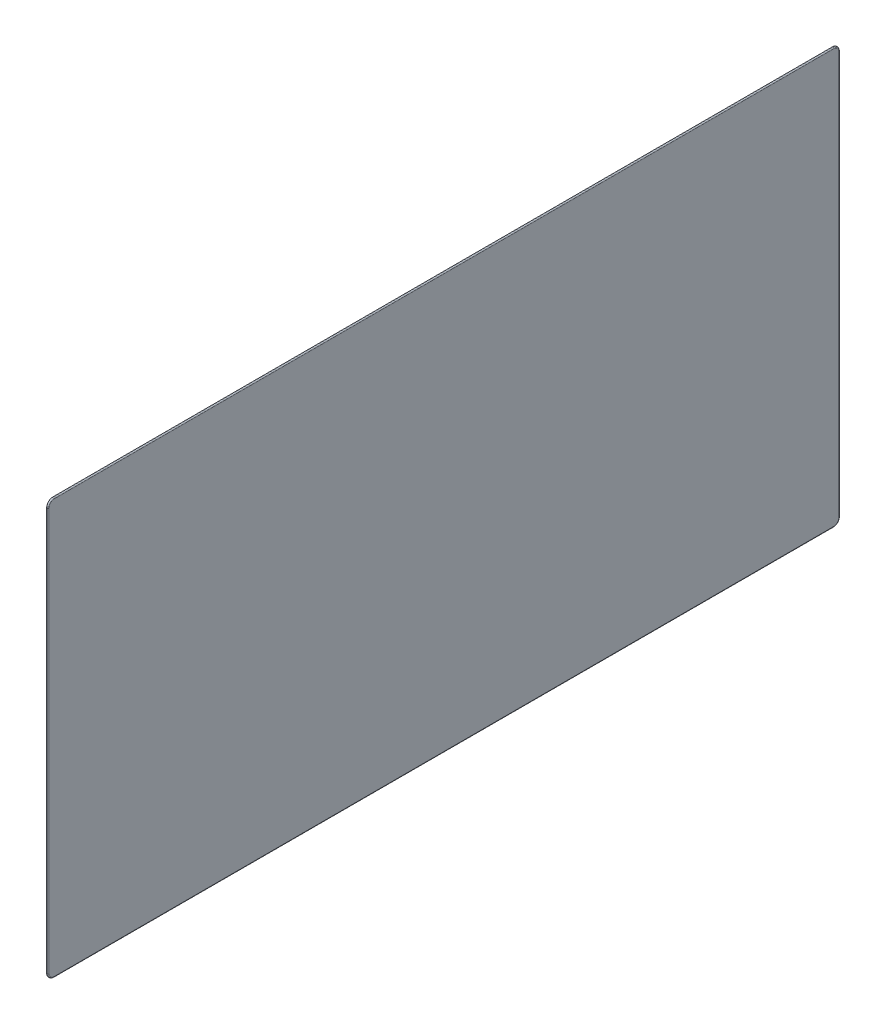
ISO-10303-21;
HEADER;
FILE_DESCRIPTION(('STEP AP214'),'2;1');
FILE_NAME('part.step','',(''),(''),'','','');
FILE_SCHEMA(('AUTOMOTIVE_DESIGN { 1 0 10303 214 1 1 1 1 }'));
ENDSEC;
DATA;
#1=APPLICATION_CONTEXT('core data for automotive mechanical design processes');
#2=APPLICATION_PROTOCOL_DEFINITION('international standard','automotive_design',2000,#1);
#3=PRODUCT_CONTEXT('',#1,'mechanical');
#4=PRODUCT('Part','Part','',(#3));
#5=PRODUCT_RELATED_PRODUCT_CATEGORY('part','',(#4));
#6=PRODUCT_DEFINITION_FORMATION('','',#4);
#7=PRODUCT_DEFINITION_CONTEXT('part definition',#1,'design');
#8=PRODUCT_DEFINITION('design','',#6,#7);
#9=PRODUCT_DEFINITION_SHAPE('','',#8);
#10=(LENGTH_UNIT() NAMED_UNIT(*) SI_UNIT(.MILLI.,.METRE.));
#11=(NAMED_UNIT(*) PLANE_ANGLE_UNIT() SI_UNIT($,.RADIAN.));
#12=(NAMED_UNIT(*) SI_UNIT($,.STERADIAN.) SOLID_ANGLE_UNIT());
#13=UNCERTAINTY_MEASURE_WITH_UNIT(LENGTH_MEASURE(1.E-05),#10,'distance_accuracy_value','');
#14=(GEOMETRIC_REPRESENTATION_CONTEXT(3) GLOBAL_UNCERTAINTY_ASSIGNED_CONTEXT((#13)) GLOBAL_UNIT_ASSIGNED_CONTEXT((#10,
#11,#12)) REPRESENTATION_CONTEXT('',''));
#15=CARTESIAN_POINT('',(0.,0.,0.));
#16=DIRECTION('',(0.,0.,1.));
#17=DIRECTION('',(1.,0.,0.));
#18=AXIS2_PLACEMENT_3D('',#15,#16,#17);
#19=CARTESIAN_POINT('',(717.31,75.9999999999999,-182.218894283865));
#20=DIRECTION('',(-1.,0.,0.));
#21=DIRECTION('',(0.,0.,1.));
#22=AXIS2_PLACEMENT_3D('',#19,#20,#21);
#23=CYLINDRICAL_SURFACE('',#22,3.);
#24=DIRECTION('',(-1.,0.,0.));
#25=VECTOR('',#24,1.);
#26=CARTESIAN_POINT('',(717.31,76.,-185.218894283865));
#27=LINE('',#26,#25);
#28=CARTESIAN_POINT('',(716.81,76.,-185.218894283865));
#29=VERTEX_POINT('',#28);
#30=CARTESIAN_POINT('',(716.7,76.,-185.218894283865));
#31=VERTEX_POINT('',#30);
#32=EDGE_CURVE('E123',#29,#31,#27,.T.);
#33=ORIENTED_EDGE('',*,*,#32,.F.);
#34=CARTESIAN_POINT('',(716.81,75.9999999999999,-182.218894283865));
#35=DIRECTION('',(1.,0.,0.));
#36=DIRECTION('',(0.,0.,-1.));
#37=AXIS2_PLACEMENT_3D('',#34,#35,#36);
#38=CIRCLE('',#37,3.);
#39=CARTESIAN_POINT('',(716.81,72.9999999999999,-182.218894283865));
#40=VERTEX_POINT('',#39);
#41=EDGE_CURVE('E11',#29,#40,#38,.F.);
#42=ORIENTED_EDGE('',*,*,#41,.T.);
#43=DIRECTION('',(-1.,0.,0.));
#44=VECTOR('',#43,1.);
#45=CARTESIAN_POINT('',(717.31,72.9999999999999,-182.218894283865));
#46=LINE('',#45,#44);
#47=CARTESIAN_POINT('',(716.7,72.9999999999999,-182.218894283865));
#48=VERTEX_POINT('',#47);
#49=EDGE_CURVE('E144',#40,#48,#46,.T.);
#50=ORIENTED_EDGE('',*,*,#49,.T.);
#51=CARTESIAN_POINT('',(716.7,75.9999999999999,-182.218894283865));
#52=DIRECTION('',(1.,0.,0.));
#53=DIRECTION('',(0.,0.,-1.));
#54=AXIS2_PLACEMENT_3D('',#51,#52,#53);
#55=CIRCLE('',#54,3.);
#56=EDGE_CURVE('E138',#48,#31,#55,.T.);
#57=ORIENTED_EDGE('',*,*,#56,.T.);
#58=EDGE_LOOP('',(#33,#42,#50,#57));
#59=FACE_BOUND('',#58,.T.);
#60=ADVANCED_FACE('F35',(#59),#23,.T.);
#61=CARTESIAN_POINT('',(717.31,76.,-185.218894283865));
#62=DIRECTION('',(0.,0.,1.));
#63=DIRECTION('',(0.,-1.,0.));
#64=AXIS2_PLACEMENT_3D('',#61,#62,#63);
#65=PLANE('',#64);
#66=DIRECTION('',(-1.,0.,0.));
#67=VECTOR('',#66,1.);
#68=CARTESIAN_POINT('',(717.31,264.432,-185.218894283865));
#69=LINE('',#68,#67);
#70=CARTESIAN_POINT('',(716.81,264.432,-185.218894283865));
#71=VERTEX_POINT('',#70);
#72=CARTESIAN_POINT('',(716.7,264.432,-185.218894283865));
#73=VERTEX_POINT('',#72);
#74=EDGE_CURVE('E132',#71,#73,#69,.T.);
#75=ORIENTED_EDGE('',*,*,#74,.F.);
#76=DIRECTION('',(0.,1.,0.));
#77=VECTOR('',#76,1.);
#78=CARTESIAN_POINT('',(716.81,76.,-185.218894283865));
#79=LINE('',#78,#77);
#80=EDGE_CURVE('E44',#71,#29,#79,.F.);
#81=ORIENTED_EDGE('',*,*,#80,.T.);
#82=ORIENTED_EDGE('',*,*,#32,.T.);
#83=DIRECTION('',(0.,1.,0.));
#84=VECTOR('',#83,1.);
#85=CARTESIAN_POINT('',(716.7,76.,-185.218894283865));
#86=LINE('',#85,#84);
#87=EDGE_CURVE('E126',#31,#73,#86,.T.);
#88=ORIENTED_EDGE('',*,*,#87,.T.);
#89=EDGE_LOOP('',(#75,#81,#82,#88));
#90=FACE_BOUND('',#89,.T.);
#91=ADVANCED_FACE('F125',(#90),#65,.F.);
#92=CARTESIAN_POINT('',(717.31,264.432,-182.218894283865));
#93=DIRECTION('',(-1.,0.,0.));
#94=DIRECTION('',(0.,0.,1.));
#95=AXIS2_PLACEMENT_3D('',#92,#93,#94);
#96=CYLINDRICAL_SURFACE('',#95,3.);
#97=DIRECTION('',(-1.,0.,0.));
#98=VECTOR('',#97,1.);
#99=CARTESIAN_POINT('',(717.31,267.432,-182.218894283865));
#100=LINE('',#99,#98);
#101=CARTESIAN_POINT('',(716.81,267.432,-182.218894283865));
#102=VERTEX_POINT('',#101);
#103=CARTESIAN_POINT('',(716.7,267.432,-182.218894283865));
#104=VERTEX_POINT('',#103);
#105=EDGE_CURVE('E174',#102,#104,#100,.T.);
#106=ORIENTED_EDGE('',*,*,#105,.F.);
#107=CARTESIAN_POINT('',(716.81,264.432,-182.218894283865));
#108=DIRECTION('',(1.,0.,0.));
#109=DIRECTION('',(0.,0.,-1.));
#110=AXIS2_PLACEMENT_3D('',#107,#108,#109);
#111=CIRCLE('',#110,3.);
#112=EDGE_CURVE('E59',#102,#71,#111,.F.);
#113=ORIENTED_EDGE('',*,*,#112,.T.);
#114=ORIENTED_EDGE('',*,*,#74,.T.);
#115=CARTESIAN_POINT('',(716.7,264.432,-182.218894283865));
#116=DIRECTION('',(1.,0.,0.));
#117=DIRECTION('',(0.,0.,-1.));
#118=AXIS2_PLACEMENT_3D('',#115,#116,#117);
#119=CIRCLE('',#118,3.);
#120=EDGE_CURVE('E141',#73,#104,#119,.T.);
#121=ORIENTED_EDGE('',*,*,#120,.T.);
#122=EDGE_LOOP('',(#106,#113,#114,#121));
#123=FACE_BOUND('',#122,.T.);
#124=ADVANCED_FACE('F277',(#123),#96,.T.);
#125=CARTESIAN_POINT('',(717.31,267.432,0.));
#126=DIRECTION('',(0.,-1.,0.));
#127=DIRECTION('',(0.,0.,-1.));
#128=AXIS2_PLACEMENT_3D('',#125,#126,#127);
#129=PLANE('',#128);
#130=DIRECTION('',(-1.,0.,0.));
#131=VECTOR('',#130,1.);
#132=CARTESIAN_POINT('',(717.31,267.432,182.218894283865));
#133=LINE('',#132,#131);
#134=CARTESIAN_POINT('',(716.81,267.432,182.218894283865));
#135=VERTEX_POINT('',#134);
#136=CARTESIAN_POINT('',(716.7,267.432,182.218894283865));
#137=VERTEX_POINT('',#136);
#138=EDGE_CURVE('E172',#135,#137,#133,.T.);
#139=ORIENTED_EDGE('',*,*,#138,.F.);
#140=DIRECTION('',(0.,0.,1.));
#141=VECTOR('',#140,1.);
#142=CARTESIAN_POINT('',(716.81,267.432,-182.218894283865));
#143=LINE('',#142,#141);
#144=EDGE_CURVE('E202',#135,#102,#143,.F.);
#145=ORIENTED_EDGE('',*,*,#144,.T.);
#146=ORIENTED_EDGE('',*,*,#105,.T.);
#147=DIRECTION('',(0.,0.,1.));
#148=VECTOR('',#147,1.);
#149=CARTESIAN_POINT('',(716.7,267.432,0.));
#150=LINE('',#149,#148);
#151=EDGE_CURVE('E151',#104,#137,#150,.T.);
#152=ORIENTED_EDGE('',*,*,#151,.T.);
#153=EDGE_LOOP('',(#139,#145,#146,#152));
#154=FACE_BOUND('',#153,.T.);
#155=ADVANCED_FACE('F275',(#154),#129,.F.);
#156=CARTESIAN_POINT('',(717.31,264.432,182.218894283865));
#157=DIRECTION('',(-1.,0.,0.));
#158=DIRECTION('',(0.,0.,1.));
#159=AXIS2_PLACEMENT_3D('',#156,#157,#158);
#160=CYLINDRICAL_SURFACE('',#159,3.);
#161=DIRECTION('',(-1.,0.,0.));
#162=VECTOR('',#161,1.);
#163=CARTESIAN_POINT('',(717.31,264.432,185.218894283865));
#164=LINE('',#163,#162);
#165=CARTESIAN_POINT('',(716.81,264.432,185.218894283865));
#166=VERTEX_POINT('',#165);
#167=CARTESIAN_POINT('',(716.7,264.432,185.218894283865));
#168=VERTEX_POINT('',#167);
#169=EDGE_CURVE('E170',#166,#168,#164,.T.);
#170=ORIENTED_EDGE('',*,*,#169,.F.);
#171=CARTESIAN_POINT('',(716.81,264.432,182.218894283865));
#172=DIRECTION('',(1.,0.,0.));
#173=DIRECTION('',(0.,0.,-1.));
#174=AXIS2_PLACEMENT_3D('',#171,#172,#173);
#175=CIRCLE('',#174,3.);
#176=EDGE_CURVE('E200',#166,#135,#175,.F.);
#177=ORIENTED_EDGE('',*,*,#176,.T.);
#178=ORIENTED_EDGE('',*,*,#138,.T.);
#179=CARTESIAN_POINT('',(716.7,264.432,182.218894283865));
#180=DIRECTION('',(1.,0.,0.));
#181=DIRECTION('',(0.,0.,-1.));
#182=AXIS2_PLACEMENT_3D('',#179,#180,#181);
#183=CIRCLE('',#182,3.);
#184=EDGE_CURVE('E154',#137,#168,#183,.T.);
#185=ORIENTED_EDGE('',*,*,#184,.T.);
#186=EDGE_LOOP('',(#170,#177,#178,#185));
#187=FACE_BOUND('',#186,.T.);
#188=ADVANCED_FACE('F273',(#187),#160,.T.);
#189=CARTESIAN_POINT('',(717.31,264.432,185.218894283865));
#190=DIRECTION('',(0.,0.,-1.));
#191=DIRECTION('',(0.,1.,0.));
#192=AXIS2_PLACEMENT_3D('',#189,#190,#191);
#193=PLANE('',#192);
#194=DIRECTION('',(-1.,0.,0.));
#195=VECTOR('',#194,1.);
#196=CARTESIAN_POINT('',(717.31,76.,185.218894283865));
#197=LINE('',#196,#195);
#198=CARTESIAN_POINT('',(716.81,76.,185.218894283865));
#199=VERTEX_POINT('',#198);
#200=CARTESIAN_POINT('',(716.7,76.,185.218894283865));
#201=VERTEX_POINT('',#200);
#202=EDGE_CURVE('E168',#199,#201,#197,.T.);
#203=ORIENTED_EDGE('',*,*,#202,.F.);
#204=DIRECTION('',(0.,-1.,0.));
#205=VECTOR('',#204,1.);
#206=CARTESIAN_POINT('',(716.81,264.432,185.218894283865));
#207=LINE('',#206,#205);
#208=EDGE_CURVE('E198',#199,#166,#207,.F.);
#209=ORIENTED_EDGE('',*,*,#208,.T.);
#210=ORIENTED_EDGE('',*,*,#169,.T.);
#211=DIRECTION('',(0.,-1.,0.));
#212=VECTOR('',#211,1.);
#213=CARTESIAN_POINT('',(716.7,264.432,185.218894283865));
#214=LINE('',#213,#212);
#215=EDGE_CURVE('E157',#168,#201,#214,.T.);
#216=ORIENTED_EDGE('',*,*,#215,.T.);
#217=EDGE_LOOP('',(#203,#209,#210,#216));
#218=FACE_BOUND('',#217,.T.);
#219=ADVANCED_FACE('F261',(#218),#193,.F.);
#220=CARTESIAN_POINT('',(717.31,75.9999999999999,182.218894283865));
#221=DIRECTION('',(-1.,0.,0.));
#222=DIRECTION('',(0.,0.,1.));
#223=AXIS2_PLACEMENT_3D('',#220,#221,#222);
#224=CYLINDRICAL_SURFACE('',#223,3.);
#225=DIRECTION('',(-1.,0.,0.));
#226=VECTOR('',#225,1.);
#227=CARTESIAN_POINT('',(717.31,72.9999999999999,182.218894283865));
#228=LINE('',#227,#226);
#229=CARTESIAN_POINT('',(716.81,72.9999999999999,182.218894283865));
#230=VERTEX_POINT('',#229);
#231=CARTESIAN_POINT('',(716.7,72.9999999999999,182.218894283865));
#232=VERTEX_POINT('',#231);
#233=EDGE_CURVE('E166',#230,#232,#228,.T.);
#234=ORIENTED_EDGE('',*,*,#233,.F.);
#235=CARTESIAN_POINT('',(716.81,75.9999999999999,182.218894283865));
#236=DIRECTION('',(1.,0.,0.));
#237=DIRECTION('',(0.,0.,-1.));
#238=AXIS2_PLACEMENT_3D('',#235,#236,#237);
#239=CIRCLE('',#238,3.);
#240=EDGE_CURVE('E196',#230,#199,#239,.F.);
#241=ORIENTED_EDGE('',*,*,#240,.T.);
#242=ORIENTED_EDGE('',*,*,#202,.T.);
#243=CARTESIAN_POINT('',(716.7,75.9999999999999,182.218894283865));
#244=DIRECTION('',(1.,0.,0.));
#245=DIRECTION('',(0.,0.,-1.));
#246=AXIS2_PLACEMENT_3D('',#243,#244,#245);
#247=CIRCLE('',#246,3.);
#248=EDGE_CURVE('E160',#201,#232,#247,.T.);
#249=ORIENTED_EDGE('',*,*,#248,.T.);
#250=EDGE_LOOP('',(#234,#241,#242,#249));
#251=FACE_BOUND('',#250,.T.);
#252=ADVANCED_FACE('F258',(#251),#224,.T.);
#253=CARTESIAN_POINT('',(717.31,73.,0.));
#254=DIRECTION('',(0.,1.,0.));
#255=DIRECTION('',(0.,0.,1.));
#256=AXIS2_PLACEMENT_3D('',#253,#254,#255);
#257=PLANE('',#256);
#258=ORIENTED_EDGE('',*,*,#49,.F.);
#259=DIRECTION('',(0.,0.,-1.));
#260=VECTOR('',#259,1.);
#261=CARTESIAN_POINT('',(716.81,73.0000000000001,182.218894283865));
#262=LINE('',#261,#260);
#263=EDGE_CURVE('E193',#40,#230,#262,.F.);
#264=ORIENTED_EDGE('',*,*,#263,.T.);
#265=ORIENTED_EDGE('',*,*,#233,.T.);
#266=DIRECTION('',(0.,0.,-1.));
#267=VECTOR('',#266,1.);
#268=CARTESIAN_POINT('',(716.7,73.,0.));
#269=LINE('',#268,#267);
#270=EDGE_CURVE('E163',#232,#48,#269,.T.);
#271=ORIENTED_EDGE('',*,*,#270,.T.);
#272=EDGE_LOOP('',(#258,#264,#265,#271));
#273=FACE_BOUND('',#272,.T.);
#274=ADVANCED_FACE('F245',(#273),#257,.F.);
#275=CARTESIAN_POINT('',(717.31,75.9999999999999,-182.218894283865));
#276=DIRECTION('',(1.,0.,0.));
#277=DIRECTION('',(0.,0.,-1.));
#278=AXIS2_PLACEMENT_3D('',#275,#276,#277);
#279=PLANE('',#278);
#280=CARTESIAN_POINT('',(717.31,75.9999999999999,182.218894283865));
#281=DIRECTION('',(1.,0.,0.));
#282=DIRECTION('',(0.,0.,-1.));
#283=AXIS2_PLACEMENT_3D('',#280,#281,#282);
#284=CIRCLE('',#283,2.5);
#285=CARTESIAN_POINT('',(717.31,76.,184.718894283865));
#286=VERTEX_POINT('',#285);
#287=CARTESIAN_POINT('',(717.31,73.4999999999999,182.218894283865));
#288=VERTEX_POINT('',#287);
#289=EDGE_CURVE('E188',#286,#288,#284,.T.);
#290=ORIENTED_EDGE('',*,*,#289,.T.);
#291=DIRECTION('',(0.,0.,-1.));
#292=VECTOR('',#291,1.);
#293=CARTESIAN_POINT('',(717.31,73.4999999999999,-182.218894283865));
#294=LINE('',#293,#292);
#295=CARTESIAN_POINT('',(717.31,73.4999999999999,-182.218894283865));
#296=VERTEX_POINT('',#295);
#297=EDGE_CURVE('E190',#288,#296,#294,.T.);
#298=ORIENTED_EDGE('',*,*,#297,.T.);
#299=CARTESIAN_POINT('',(717.31,75.9999999999999,-182.218894283865));
#300=DIRECTION('',(1.,0.,0.));
#301=DIRECTION('',(0.,0.,-1.));
#302=AXIS2_PLACEMENT_3D('',#299,#300,#301);
#303=CIRCLE('',#302,2.5);
#304=CARTESIAN_POINT('',(717.31,76.,-184.718894283865));
#305=VERTEX_POINT('',#304);
#306=EDGE_CURVE('E131',#296,#305,#303,.T.);
#307=ORIENTED_EDGE('',*,*,#306,.T.);
#308=DIRECTION('',(0.,1.,0.));
#309=VECTOR('',#308,1.);
#310=CARTESIAN_POINT('',(717.31,264.432,-184.718894283865));
#311=LINE('',#310,#309);
#312=CARTESIAN_POINT('',(717.31,264.432,-184.718894283865));
#313=VERTEX_POINT('',#312);
#314=EDGE_CURVE('E178',#305,#313,#311,.T.);
#315=ORIENTED_EDGE('',*,*,#314,.T.);
#316=CARTESIAN_POINT('',(717.31,264.432,-182.218894283865));
#317=DIRECTION('',(1.,0.,0.));
#318=DIRECTION('',(0.,0.,-1.));
#319=AXIS2_PLACEMENT_3D('',#316,#317,#318);
#320=CIRCLE('',#319,2.5);
#321=CARTESIAN_POINT('',(717.31,266.932,-182.218894283865));
#322=VERTEX_POINT('',#321);
#323=EDGE_CURVE('E180',#313,#322,#320,.T.);
#324=ORIENTED_EDGE('',*,*,#323,.T.);
#325=DIRECTION('',(0.,0.,1.));
#326=VECTOR('',#325,1.);
#327=CARTESIAN_POINT('',(717.31,266.932,182.218894283865));
#328=LINE('',#327,#326);
#329=CARTESIAN_POINT('',(717.31,266.932,182.218894283865));
#330=VERTEX_POINT('',#329);
#331=EDGE_CURVE('E182',#322,#330,#328,.T.);
#332=ORIENTED_EDGE('',*,*,#331,.T.);
#333=CARTESIAN_POINT('',(717.31,264.432,182.218894283865));
#334=DIRECTION('',(1.,0.,0.));
#335=DIRECTION('',(0.,0.,-1.));
#336=AXIS2_PLACEMENT_3D('',#333,#334,#335);
#337=CIRCLE('',#336,2.5);
#338=CARTESIAN_POINT('',(717.31,264.432,184.718894283865));
#339=VERTEX_POINT('',#338);
#340=EDGE_CURVE('E184',#330,#339,#337,.T.);
#341=ORIENTED_EDGE('',*,*,#340,.T.);
#342=DIRECTION('',(0.,-1.,0.));
#343=VECTOR('',#342,1.);
#344=CARTESIAN_POINT('',(717.31,76.,184.718894283865));
#345=LINE('',#344,#343);
#346=EDGE_CURVE('E186',#339,#286,#345,.T.);
#347=ORIENTED_EDGE('',*,*,#346,.T.);
#348=EDGE_LOOP('',(#290,#298,#307,#315,#324,#332,#341,#347));
#349=FACE_BOUND('',#348,.T.);
#350=ADVANCED_FACE('F233',(#349),#279,.T.);
#351=CARTESIAN_POINT('',(716.7,75.9999999999999,-182.218894283865));
#352=DIRECTION('',(1.,0.,0.));
#353=DIRECTION('',(0.,0.,-1.));
#354=AXIS2_PLACEMENT_3D('',#351,#352,#353);
#355=PLANE('',#354);
#356=ORIENTED_EDGE('',*,*,#56,.F.);
#357=ORIENTED_EDGE('',*,*,#270,.F.);
#358=ORIENTED_EDGE('',*,*,#248,.F.);
#359=ORIENTED_EDGE('',*,*,#215,.F.);
#360=ORIENTED_EDGE('',*,*,#184,.F.);
#361=ORIENTED_EDGE('',*,*,#151,.F.);
#362=ORIENTED_EDGE('',*,*,#120,.F.);
#363=ORIENTED_EDGE('',*,*,#87,.F.);
#364=EDGE_LOOP('',(#356,#357,#358,#359,#360,#361,#362,#363));
#365=FACE_BOUND('',#364,.T.);
#366=ADVANCED_FACE('F136',(#365),#355,.F.);
#367=CARTESIAN_POINT('',(716.81,266.932,-182.218894283865));
#368=DIRECTION('',(0.,0.,-1.));
#369=DIRECTION('',(-1.,0.,0.));
#370=AXIS2_PLACEMENT_3D('',#367,#368,#369);
#371=CYLINDRICAL_SURFACE('',#370,0.5);
#372=CARTESIAN_POINT('',(716.81,266.932,-182.218894283865));
#373=DIRECTION('',(0.,0.,-1.));
#374=DIRECTION('',(-1.,0.,0.));
#375=AXIS2_PLACEMENT_3D('',#372,#373,#374);
#376=CIRCLE('',#375,0.5);
#377=EDGE_CURVE('E148',#102,#322,#376,.T.);
#378=ORIENTED_EDGE('',*,*,#377,.F.);
#379=ORIENTED_EDGE('',*,*,#144,.F.);
#380=CARTESIAN_POINT('',(716.81,266.932,182.218894283865));
#381=DIRECTION('',(0.,0.,1.));
#382=DIRECTION('',(1.,0.,0.));
#383=AXIS2_PLACEMENT_3D('',#380,#381,#382);
#384=CIRCLE('',#383,0.5);
#385=EDGE_CURVE('E39',#330,#135,#384,.T.);
#386=ORIENTED_EDGE('',*,*,#385,.F.);
#387=ORIENTED_EDGE('',*,*,#331,.F.);
#388=EDGE_LOOP('',(#378,#379,#386,#387));
#389=FACE_BOUND('',#388,.T.);
#390=ADVANCED_FACE('F37',(#389),#371,.T.);
#391=CARTESIAN_POINT('',(716.81,264.432,182.218894283865));
#392=DIRECTION('',(1.,0.,0.));
#393=DIRECTION('',(0.,0.,-1.));
#394=AXIS2_PLACEMENT_3D('',#391,#392,#393);
#395=TOROIDAL_SURFACE('',#394,2.5,0.5);
#396=ORIENTED_EDGE('',*,*,#385,.T.);
#397=ORIENTED_EDGE('',*,*,#176,.F.);
#398=CARTESIAN_POINT('',(716.81,264.432,184.718894283865));
#399=DIRECTION('',(0.,-1.,0.));
#400=DIRECTION('',(0.,0.,-1.));
#401=AXIS2_PLACEMENT_3D('',#398,#399,#400);
#402=CIRCLE('',#401,0.5);
#403=EDGE_CURVE('E219',#339,#166,#402,.T.);
#404=ORIENTED_EDGE('',*,*,#403,.F.);
#405=ORIENTED_EDGE('',*,*,#340,.F.);
#406=EDGE_LOOP('',(#396,#397,#404,#405));
#407=FACE_BOUND('',#406,.T.);
#408=ADVANCED_FACE('F270',(#407),#395,.T.);
#409=CARTESIAN_POINT('',(716.81,264.432,-182.218894283865));
#410=DIRECTION('',(1.,0.,0.));
#411=DIRECTION('',(0.,0.,-1.));
#412=AXIS2_PLACEMENT_3D('',#409,#410,#411);
#413=TOROIDAL_SURFACE('',#412,2.5,0.5);
#414=ORIENTED_EDGE('',*,*,#377,.T.);
#415=ORIENTED_EDGE('',*,*,#323,.F.);
#416=CARTESIAN_POINT('',(716.81,264.432,-184.718894283865));
#417=DIRECTION('',(0.,-1.,0.));
#418=DIRECTION('',(0.,0.,-1.));
#419=AXIS2_PLACEMENT_3D('',#416,#417,#418);
#420=CIRCLE('',#419,0.5);
#421=EDGE_CURVE('E216',#71,#313,#420,.T.);
#422=ORIENTED_EDGE('',*,*,#421,.F.);
#423=ORIENTED_EDGE('',*,*,#112,.F.);
#424=EDGE_LOOP('',(#414,#415,#422,#423));
#425=FACE_BOUND('',#424,.T.);
#426=ADVANCED_FACE('F225',(#425),#413,.T.);
#427=CARTESIAN_POINT('',(716.81,76.0000000000002,184.718894283865));
#428=DIRECTION('',(0.,1.,0.));
#429=DIRECTION('',(0.,0.,1.));
#430=AXIS2_PLACEMENT_3D('',#427,#428,#429);
#431=CYLINDRICAL_SURFACE('',#430,0.5);
#432=ORIENTED_EDGE('',*,*,#403,.T.);
#433=ORIENTED_EDGE('',*,*,#208,.F.);
#434=CARTESIAN_POINT('',(716.81,76.,184.718894283865));
#435=DIRECTION('',(0.,-1.,0.));
#436=DIRECTION('',(0.,0.,-1.));
#437=AXIS2_PLACEMENT_3D('',#434,#435,#436);
#438=CIRCLE('',#437,0.5);
#439=EDGE_CURVE('E213',#286,#199,#438,.T.);
#440=ORIENTED_EDGE('',*,*,#439,.F.);
#441=ORIENTED_EDGE('',*,*,#346,.F.);
#442=EDGE_LOOP('',(#432,#433,#440,#441));
#443=FACE_BOUND('',#442,.T.);
#444=ADVANCED_FACE('F266',(#443),#431,.T.);
#445=CARTESIAN_POINT('',(716.81,75.9999999999999,-184.718894283865));
#446=DIRECTION('',(0.,-1.,0.));
#447=DIRECTION('',(0.,0.,-1.));
#448=AXIS2_PLACEMENT_3D('',#445,#446,#447);
#449=CYLINDRICAL_SURFACE('',#448,0.5);
#450=ORIENTED_EDGE('',*,*,#421,.T.);
#451=ORIENTED_EDGE('',*,*,#314,.F.);
#452=CARTESIAN_POINT('',(716.81,76.,-184.718894283865));
#453=DIRECTION('',(0.,-1.,0.));
#454=DIRECTION('',(0.,0.,-1.));
#455=AXIS2_PLACEMENT_3D('',#452,#453,#454);
#456=CIRCLE('',#455,0.5);
#457=EDGE_CURVE('E210',#29,#305,#456,.T.);
#458=ORIENTED_EDGE('',*,*,#457,.F.);
#459=ORIENTED_EDGE('',*,*,#80,.F.);
#460=EDGE_LOOP('',(#450,#451,#458,#459));
#461=FACE_BOUND('',#460,.T.);
#462=ADVANCED_FACE('F238',(#461),#449,.T.);
#463=CARTESIAN_POINT('',(716.81,75.9999999999999,182.218894283865));
#464=DIRECTION('',(1.,0.,0.));
#465=DIRECTION('',(0.,0.,-1.));
#466=AXIS2_PLACEMENT_3D('',#463,#464,#465);
#467=TOROIDAL_SURFACE('',#466,2.5,0.5);
#468=ORIENTED_EDGE('',*,*,#439,.T.);
#469=ORIENTED_EDGE('',*,*,#240,.F.);
#470=CARTESIAN_POINT('',(716.81,73.4999999999999,182.218894283865));
#471=DIRECTION('',(0.,0.,-1.));
#472=DIRECTION('',(-1.,0.,0.));
#473=AXIS2_PLACEMENT_3D('',#470,#471,#472);
#474=CIRCLE('',#473,0.5);
#475=EDGE_CURVE('E208',#288,#230,#474,.T.);
#476=ORIENTED_EDGE('',*,*,#475,.F.);
#477=ORIENTED_EDGE('',*,*,#289,.F.);
#478=EDGE_LOOP('',(#468,#469,#476,#477));
#479=FACE_BOUND('',#478,.T.);
#480=ADVANCED_FACE('F254',(#479),#467,.T.);
#481=CARTESIAN_POINT('',(716.81,75.9999999999999,-182.218894283865));
#482=DIRECTION('',(1.,0.,0.));
#483=DIRECTION('',(0.,0.,-1.));
#484=AXIS2_PLACEMENT_3D('',#481,#482,#483);
#485=TOROIDAL_SURFACE('',#484,2.5,0.5);
#486=ORIENTED_EDGE('',*,*,#457,.T.);
#487=ORIENTED_EDGE('',*,*,#306,.F.);
#488=CARTESIAN_POINT('',(716.81,73.4999999999999,-182.218894283865));
#489=DIRECTION('',(0.,0.,1.));
#490=DIRECTION('',(1.,0.,0.));
#491=AXIS2_PLACEMENT_3D('',#488,#489,#490);
#492=CIRCLE('',#491,0.5);
#493=EDGE_CURVE('E206',#40,#296,#492,.T.);
#494=ORIENTED_EDGE('',*,*,#493,.F.);
#495=ORIENTED_EDGE('',*,*,#41,.F.);
#496=EDGE_LOOP('',(#486,#487,#494,#495));
#497=FACE_BOUND('',#496,.T.);
#498=ADVANCED_FACE('F241',(#497),#485,.T.);
#499=CARTESIAN_POINT('',(716.81,73.4999999999999,-182.218894283865));
#500=DIRECTION('',(0.,0.,1.));
#501=DIRECTION('',(0.,-1.,0.));
#502=AXIS2_PLACEMENT_3D('',#499,#500,#501);
#503=CYLINDRICAL_SURFACE('',#502,0.5);
#504=ORIENTED_EDGE('',*,*,#475,.T.);
#505=ORIENTED_EDGE('',*,*,#263,.F.);
#506=ORIENTED_EDGE('',*,*,#493,.T.);
#507=ORIENTED_EDGE('',*,*,#297,.F.);
#508=EDGE_LOOP('',(#504,#505,#506,#507));
#509=FACE_BOUND('',#508,.T.);
#510=ADVANCED_FACE('F248',(#509),#503,.T.);
#511=CLOSED_SHELL('',(#60,#91,#124,#155,#188,#219,#252,#274,#350,#366,#390,#408,#426,#444,#462,
#480,#498,#510));
#512=MANIFOLD_SOLID_BREP('B2',#511);
#513=ADVANCED_BREP_SHAPE_REPRESENTATION('',(#18,#512),#14);
#514=SHAPE_DEFINITION_REPRESENTATION(#9,#513);
ENDSEC;
END-ISO-10303-21;
